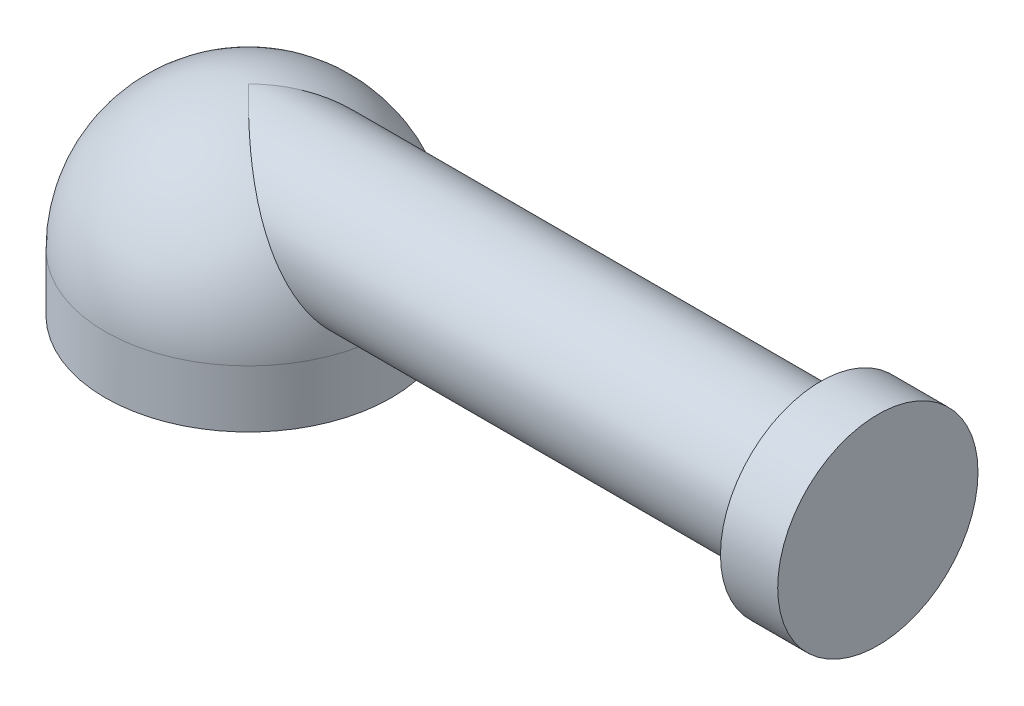
ISO-10303-21;
HEADER;
FILE_DESCRIPTION(('STEP AP214'),'2;1');
FILE_NAME('part.step','',(''),(''),'','','');
FILE_SCHEMA(('AUTOMOTIVE_DESIGN { 1 0 10303 214 1 1 1 1 }'));
ENDSEC;
DATA;
#1=APPLICATION_CONTEXT('core data for automotive mechanical design processes');
#2=APPLICATION_PROTOCOL_DEFINITION('international standard','automotive_design',2000,#1);
#3=PRODUCT_CONTEXT('',#1,'mechanical');
#4=PRODUCT('Part','Part','',(#3));
#5=PRODUCT_RELATED_PRODUCT_CATEGORY('part','',(#4));
#6=PRODUCT_DEFINITION_FORMATION('','',#4);
#7=PRODUCT_DEFINITION_CONTEXT('part definition',#1,'design');
#8=PRODUCT_DEFINITION('design','',#6,#7);
#9=PRODUCT_DEFINITION_SHAPE('','',#8);
#10=(LENGTH_UNIT() NAMED_UNIT(*) SI_UNIT(.MILLI.,.METRE.));
#11=(NAMED_UNIT(*) PLANE_ANGLE_UNIT() SI_UNIT($,.RADIAN.));
#12=(NAMED_UNIT(*) SI_UNIT($,.STERADIAN.) SOLID_ANGLE_UNIT());
#13=UNCERTAINTY_MEASURE_WITH_UNIT(LENGTH_MEASURE(1.E-05),#10,'distance_accuracy_value','');
#14=(GEOMETRIC_REPRESENTATION_CONTEXT(3) GLOBAL_UNCERTAINTY_ASSIGNED_CONTEXT((#13)) GLOBAL_UNIT_ASSIGNED_CONTEXT((#10,
#11,#12)) REPRESENTATION_CONTEXT('',''));
#15=CARTESIAN_POINT('',(0.,0.,0.));
#16=DIRECTION('',(0.,0.,1.));
#17=DIRECTION('',(1.,0.,0.));
#18=AXIS2_PLACEMENT_3D('',#15,#16,#17);
#19=CARTESIAN_POINT('',(0.,1.,0.));
#20=DIRECTION('',(0.,-1.,0.));
#21=DIRECTION('',(1.,0.,0.));
#22=AXIS2_PLACEMENT_3D('',#19,#20,#21);
#23=SPHERICAL_SURFACE('',#22,2.5);
#24=CARTESIAN_POINT('',(0.,3.5,0.));
#25=CARTESIAN_POINT('',(9.03465725767507E-10,3.5,-2.06603010067391E-06));
#26=CARTESIAN_POINT('',(1.40532408758934E-07,3.4999999999936,-4.13199815144162E-06));
#27=CARTESIAN_POINT('',(6.53975665339281E-07,3.49999999996992,-8.23515255964748E-06));
#28=CARTESIAN_POINT('',(1.02809638732858E-06,3.49999999995262,-1.0272297687369E-05));
#29=CARTESIAN_POINT('',(2.45048543547456E-06,3.49999999988667,-1.63415594684955E-05));
#30=CARTESIAN_POINT('',(3.79772910128829E-06,3.49999999982401,-2.03034893564983E-05));
#31=CARTESIAN_POINT('',(7.09223863791532E-06,3.49999999966981,-2.81414471541881E-05));
#32=CARTESIAN_POINT('',(9.06116815940649E-06,3.49999999957722,-3.20078478709065E-05));
#33=CARTESIAN_POINT('',(1.34137976448234E-05,3.49999999937095,-3.94803831920875E-05));
#34=CARTESIAN_POINT('',(1.57964479161004E-05,3.49999999925732,-4.30871445582485E-05));
#35=CARTESIAN_POINT('',(2.402061913195E-05,3.49999999886142,-5.45708131942331E-05));
#36=CARTESIAN_POINT('',(3.04121233245785E-05,3.49999999854823,-6.20538264996035E-05));
#37=CARTESIAN_POINT('',(4.39475112599543E-05,3.49999999786564,-7.60331718458684E-05));
#38=CARTESIAN_POINT('',(5.1078091916073E-05,3.49999999749719,-8.25430833792041E-05));
#39=CARTESIAN_POINT('',(7.72820483308929E-05,3.49999999609731,-0.000105448619225508));
#40=CARTESIAN_POINT('',(9.71341531021282E-05,3.49999999495188,-0.000120920093394432));
#41=CARTESIAN_POINT('',(0.000136456025350613,3.49999999201278,-0.000149768469616472));
#42=CARTESIAN_POINT('',(0.00015587304837256,3.49999999026375,-0.00016321577439628));
#43=CARTESIAN_POINT('',(0.000273199839284667,3.49999997681437,-0.000251786756117935));
#44=CARTESIAN_POINT('',(0.000354587015909807,3.49999995437845,-0.000346509765650201));
#45=CARTESIAN_POINT('',(0.000647071752567475,3.49999984531558,-0.000667196066757779));
#46=CARTESIAN_POINT('',(0.000870602926133935,3.4999997128575,-0.000878215813293108));
#47=CARTESIAN_POINT('',(0.00164605207464173,3.49999904804002,-0.0016269933482604));
#48=CARTESIAN_POINT('',(0.00218624347485647,3.49999821385135,-0.00217884474947019));
#49=CARTESIAN_POINT('',(0.00416700741413352,3.49999386223503,-0.00418667202475138));
#50=CARTESIAN_POINT('',(0.00561924575884219,3.49998818881235,-0.00562861637879351));
#51=CARTESIAN_POINT('',(0.0331442559621647,3.49983293758892,-0.0329754350340232));
#52=CARTESIAN_POINT('',(0.0590877299439648,3.49887459360956,-0.0590387968837171));
#53=CARTESIAN_POINT('',(0.110535267323236,3.49537108859278,-0.110485713211164));
#54=CARTESIAN_POINT('',(0.136038282692941,3.49285651557886,-0.135872757364566));
#55=CARTESIAN_POINT('',(0.188616591575509,3.48606388942968,-0.188096300229957));
#56=CARTESIAN_POINT('',(0.215689149061992,3.48168421958225,-0.214922748074373));
#57=CARTESIAN_POINT('',(0.269934882921645,3.471149643211,-0.268405374290015));
#58=CARTESIAN_POINT('',(0.297107852333861,3.4649856417184,-0.295059946502446));
#59=CARTESIAN_POINT('',(0.370300131728103,3.44599904239884,-0.366389010970893));
#60=CARTESIAN_POINT('',(0.416269102171267,3.43152844528726,-0.41068907079323));
#61=CARTESIAN_POINT('',(0.507341966063268,3.39786014613217,-0.497027378785424));
#62=CARTESIAN_POINT('',(0.552449191483231,3.37872846734192,-0.539087997866009));
#63=CARTESIAN_POINT('',(0.644971045216207,3.33450984476646,-0.623488172433074));
#64=CARTESIAN_POINT('',(0.692366992983383,3.30914087737651,-0.665701206585452));
#65=CARTESIAN_POINT('',(0.786882683990471,3.25322320857843,-0.747329018659638));
#66=CARTESIAN_POINT('',(0.834000717017869,3.22265537726524,-0.786732670376879));
#67=CARTESIAN_POINT('',(0.929511709296675,3.15535005188873,-0.863448924018073));
#68=CARTESIAN_POINT('',(0.977882473104846,3.11841803989198,-0.900619502578629));
#69=CARTESIAN_POINT('',(1.07381628667211,3.03968839877754,-0.970391730009778));
#70=CARTESIAN_POINT('',(1.12138012221424,2.99789585641763,-1.00299807815832));
#71=CARTESIAN_POINT('',(1.25579439994875,2.87223086377854,-1.0886035769605));
#72=CARTESIAN_POINT('',(1.3416306742188,2.78281551428343,-1.13534236337376));
#73=CARTESIAN_POINT('',(1.50818748792059,2.59289194148153,-1.20626772898903));
#74=CARTESIAN_POINT('',(1.5889534079097,2.49251452072161,-1.23069336301905));
#75=CARTESIAN_POINT('',(1.72456071902696,2.31169090061718,-1.25087680992923));
#76=CARTESIAN_POINT('',(1.78068684928329,2.23283978735695,-1.25243296629026));
#77=CARTESIAN_POINT('',(1.88922459270154,2.0735102126581,-1.24005568300901));
#78=CARTESIAN_POINT('',(1.94162998098111,1.99302930072666,-1.2260969073211));
#79=CARTESIAN_POINT('',(2.04198794922623,1.83312836123046,-1.18137828279186));
#80=CARTESIAN_POINT('',(2.08990995067002,1.75371839290745,-1.15051169290967));
#81=CARTESIAN_POINT('',(2.1797274648577,1.60032087582888,-1.07137355358718));
#82=CARTESIAN_POINT('',(2.22162992932475,1.52632712135793,-1.02312231071733));
#83=CARTESIAN_POINT('',(2.29293841499825,1.39741249348999,-0.917379141443187));
#84=CARTESIAN_POINT('',(2.32326748530558,1.34126509558173,-0.862008521899327));
#85=CARTESIAN_POINT('',(2.37749962257881,1.23929262339528,-0.73978465277191));
#86=CARTESIAN_POINT('',(2.40140980855601,1.1934561228035,-0.672944260051717));
#87=CARTESIAN_POINT('',(2.43905167475718,1.12053199775932,-0.540102487743382));
#88=CARTESIAN_POINT('',(2.45374534153547,1.09170837213939,-0.475323143235738));
#89=CARTESIAN_POINT('',(2.47728537948203,1.0452788331134,-0.340869572025986));
#90=CARTESIAN_POINT('',(2.48613600569621,1.02766475697512,-0.271198948270326));
#91=CARTESIAN_POINT('',(2.49713660428599,1.00573415198686,-0.136139178631497));
#92=CARTESIAN_POINT('',(2.49984341317038,1.00031302321876,-0.0709723397788174));
#93=CARTESIAN_POINT('',(2.50014322597658,0.99971370215609,0.0594125695685415));
#94=CARTESIAN_POINT('',(2.49773762970932,1.00453270604425,0.124630621153153));
#95=CARTESIAN_POINT('',(2.4880557093132,1.02384026623718,0.250954897882133));
#96=CARTESIAN_POINT('',(2.48094714651761,1.03799572670674,0.312125572111205));
#97=CARTESIAN_POINT('',(2.46222410986327,1.07501586130327,0.431034115370739));
#98=CARTESIAN_POINT('',(2.45060944665666,1.09788090140901,0.488771840029899));
#99=CARTESIAN_POINT('',(2.42282726836015,1.1520420322834,0.600794827144735));
#100=CARTESIAN_POINT('',(2.40655442748591,1.18353234014262,0.654959657755461));
#101=CARTESIAN_POINT('',(2.36996945345925,1.25343158378961,0.757089261533636));
#102=CARTESIAN_POINT('',(2.34965634277869,1.29184219370632,0.805052529613221));
#103=CARTESIAN_POINT('',(2.30377526315463,1.37727316973116,0.897263891747237));
#104=CARTESIAN_POINT('',(2.27793061123442,1.42471909388575,0.940978920748687));
#105=CARTESIAN_POINT('',(2.2225780288831,1.52436530277729,1.01980173891458));
#106=CARTESIAN_POINT('',(2.19306861090012,1.57656751581724,1.05490601560607));
#107=CARTESIAN_POINT('',(2.12743313033222,1.69008771872769,1.11969900859921));
#108=CARTESIAN_POINT('',(2.09093625457772,1.75177581476096,1.14836184482114));
#109=CARTESIAN_POINT('',(2.0146297359849,1.87708976451523,1.19495307774847));
#110=CARTESIAN_POINT('',(1.97481909173974,1.94071620028453,1.21287821605524));
#111=CARTESIAN_POINT('',(1.88689595545522,2.07672109237309,1.24012151776484));
#112=CARTESIAN_POINT('',(1.83838443906477,2.14913483763001,1.24797258382119));
#113=CARTESIAN_POINT('',(1.73837828530625,2.29221884715857,1.2513394475872));
#114=CARTESIAN_POINT('',(1.68688018350903,2.36288694535463,1.24684062752375));
#115=CARTESIAN_POINT('',(1.57385969227664,2.51063948316308,1.22511764586615));
#116=CARTESIAN_POINT('',(1.511962147834,2.58718111795508,1.206153187905));
#117=CARTESIAN_POINT('',(1.38585122495946,2.73335441459941,1.15535511207576));
#118=CARTESIAN_POINT('',(1.32164420044247,2.80300331318867,1.12355466068738));
#119=CARTESIAN_POINT('',(1.18272204870167,2.9426411168766,1.04404011003238));
#120=CARTESIAN_POINT('',(1.10773228781075,3.01147911661234,0.99478696515024));
#121=CARTESIAN_POINT('',(0.954831815841421,3.13768694585008,0.884109660943233));
#122=CARTESIAN_POINT('',(0.876895219926014,3.19488762008492,0.822528715676729));
#123=CARTESIAN_POINT('',(0.753596347509903,3.27363932855364,0.718954255122888));
#124=CARTESIAN_POINT('',(0.708665896023247,3.29993215829781,0.67995187163925));
#125=CARTESIAN_POINT('',(0.618370573068708,3.34786268314659,0.599492271973325));
#126=CARTESIAN_POINT('',(0.573005177247487,3.36949374459434,0.558031663270023));
#127=CARTESIAN_POINT('',(0.484328477909014,3.40691642380004,0.475390940990978));
#128=CARTESIAN_POINT('',(0.441030835230943,3.422950187342,0.434305011298923));
#129=CARTESIAN_POINT('',(0.354467035282944,3.45048645160054,0.351060243278618));
#130=CARTESIAN_POINT('',(0.311201859347762,3.46201181162419,0.308908002511101));
#131=CARTESIAN_POINT('',(0.247975026116913,3.47556195856667,0.246778073180658));
#132=CARTESIAN_POINT('',(0.228055390357256,3.47935502645118,0.22712748543014));
#133=CARTESIAN_POINT('',(0.18791401184717,3.48603888282501,0.18739987743631));
#134=CARTESIAN_POINT('',(0.167692017219012,3.48891601241765,0.167320774969541));
#135=CARTESIAN_POINT('',(0.123446073520968,3.49413447291043,0.123325238718038));
#136=CARTESIAN_POINT('',(0.0994163148333078,3.49627585231327,0.0993914300626676));
#137=CARTESIAN_POINT('',(0.0526543657297443,3.49909929863509,0.0526110976178393));
#138=CARTESIAN_POINT('',(0.0299193574538794,3.49985112743377,0.029772377484827));
#139=CARTESIAN_POINT('',(0.00562179062610069,3.49998817444402,0.00563108364963954));
#140=CARTESIAN_POINT('',(0.00417204356710078,3.49999384250027,0.00419166644416946));
#141=CARTESIAN_POINT('',(0.00219212115036177,3.49999820430814,0.00218470176068806));
#142=CARTESIAN_POINT('',(0.00165030200793372,3.49999904324291,0.00163116279548221));
#143=CARTESIAN_POINT('',(0.000872540967923787,3.49999971159545,0.000880184255871348));
#144=CARTESIAN_POINT('',(0.000648378010231976,3.49999984470849,0.000668583210112855));
#145=CARTESIAN_POINT('',(0.00035515235772886,3.49999995423835,0.00034704891769572));
#146=CARTESIAN_POINT('',(0.000273604694731109,3.49999997675535,0.000252126204341068));
#147=CARTESIAN_POINT('',(0.000156034802061506,3.49999999024403,0.000163412015324212));
#148=CARTESIAN_POINT('',(0.000136589137997332,3.49999999199693,0.0001499518810882));
#149=CARTESIAN_POINT('',(9.72104733275933E-05,3.49999999494237,0.00012107013148015));
#150=CARTESIAN_POINT('',(7.73305424400523E-05,3.49999999609008,0.000105577644711955));
#151=CARTESIAN_POINT('',(5.10947153982158E-05,3.49999999749268,8.26404539068264E-05));
#152=CARTESIAN_POINT('',(4.39574037859507E-05,3.49999999786176,7.61229000788026E-05));
#153=CARTESIAN_POINT('',(3.04104272953063E-05,3.49999999854555,6.21261822441603E-05));
#154=CARTESIAN_POINT('',(2.40141132008445E-05,3.49999999885931,5.46333946651884E-05));
#155=CARTESIAN_POINT('',(1.5785605255543E-05,3.49999999925594,4.31349866155268E-05));
#156=CARTESIAN_POINT('',(1.34021164293603E-05,3.49999999936977,3.9523890357782E-05));
#157=CARTESIAN_POINT('',(9.04866691395487E-06,3.4999999995764,3.2042386973218E-05));
#158=CARTESIAN_POINT('',(7.07975962930498E-06,3.49999999966916,2.81713514811042E-05));
#159=CARTESIAN_POINT('',(3.78650351581824E-06,3.49999999982364,2.03243162415033E-05));
#160=CARTESIAN_POINT('',(2.44042525496108E-06,3.49999999988643,1.63579590185354E-05));
#161=CARTESIAN_POINT('',(1.02089773831582E-06,3.49999999995251,1.02822573499865E-05));
#162=CARTESIAN_POINT('',(6.47911218902655E-07,3.49999999996984,8.24301625174064E-06));
#163=CARTESIAN_POINT('',(1.3716411466838E-07,3.49999999999358,4.13580192788885E-06));
#164=CARTESIAN_POINT('',(-9.04270254798268E-10,3.5,2.06786988371191E-06));
#165=CARTESIAN_POINT('',(0.,3.5,0.));
#166=B_SPLINE_CURVE_WITH_KNOTS('',3,(#24,#25,#26,#27,#28,#29,#30,#31,#32,#33,#34,#35,#36,#37,
#38,#39,#40,#41,#42,#43,#44,#45,#46,#47,#48,#49,#50,#51,#52,#53,#54,#55,#56,#57,#58,#59,#60,#61,
#62,#63,#64,#65,#66,#67,#68,#69,#70,#71,#72,#73,#74,#75,#76,#77,#78,#79,#80,#81,#82,#83,#84,#85,
#86,#87,#88,#89,#90,#91,#92,#93,#94,#95,#96,#97,#98,#99,#100,#101,#102,#103,#104,#105,#106,#107,
#108,#109,#110,#111,#112,#113,#114,#115,#116,#117,#118,#119,#120,#121,#122,#123,#124,#125,#126,
#127,#128,#129,#130,#131,#132,#133,#134,#135,#136,#137,#138,#139,#140,#141,#142,#143,#144,#145,
#146,#147,#148,#149,#150,#151,#152,#153,#154,#155,#156,#157,#158,#159,#160,#161,#162,#163,#164,
#165),.UNSPECIFIED.,.T.,.F.,(4,2,2,2,2,2,2,2,2,2,2,2,2,2,2,2,2,2,2,2,2,2,2,2,2,2,2,2,2,2,2,2,2,
2,2,2,2,2,2,2,2,2,2,2,2,2,2,2,2,2,2,2,2,2,2,2,2,2,2,2,2,2,2,2,2,2,2,2,2,2,4),(0.,
6.19497237579534E-06,1.23980565945574E-05,2.48867198699285E-05,3.78703257486531E-05,
5.08214585247521E-05,8.02195603431655E-05,0.0001091587265821,0.000184600448047914,
0.000255359783520054,0.00062635236607428,0.00155060743073989,0.00386491318270473,
0.0100064392733568,0.120300616372325,0.228492916674136,0.343538584255776,0.459181303047181,
0.655337982070794,0.848863028289331,1.05366321445726,1.25923397319844,1.47284344756615,
1.68623134851631,2.08121897431549,2.47192344936617,2.76114546918208,3.05084048639125,
3.34238582083919,3.63359170682821,3.88555760235025,4.13724288387613,4.35328045910345,
4.56916053640325,4.76452549844168,4.95983697513106,5.14853208279965,5.33723512035975,
5.53059705214964,5.72400582416823,5.93164612757001,6.1393709906664,6.37003097679507,
6.60076092223511,6.86226919156692,7.12408712498983,7.42363283468237,7.72240946314785,
8.06032919106421,8.40285617268335,8.59781564612948,8.79305073978299,8.97829675488851,
9.16259093546582,9.24728923944126,9.33319710816037,9.43512423140785,9.531778503085,
9.53790939019433,9.54023071295022,9.5411575558037,9.54152929989953,9.5416001514674,
9.54167569720697,9.54170466664759,9.54173409599867,9.54174705932668,9.54176005520582,
9.54177255515759,9.54177876378765,9.54178496427659),.UNSPECIFIED.);
#167=CARTESIAN_POINT('',(2.5,1.,0.));
#168=VERTEX_POINT('',#167);
#169=CARTESIAN_POINT('',(0.,3.5,0.));
#170=VERTEX_POINT('',#169);
#171=EDGE_CURVE('E48',#168,#170,#166,.T.);
#172=ORIENTED_EDGE('',*,*,#171,.T.);
#173=EDGE_CURVE('E12',#170,#168,#166,.T.);
#174=ORIENTED_EDGE('',*,*,#173,.T.);
#175=CARTESIAN_POINT('',(0.,1.,0.));
#176=DIRECTION('',(0.,1.,0.));
#177=DIRECTION('',(0.,0.,1.));
#178=AXIS2_PLACEMENT_3D('',#175,#176,#177);
#179=CIRCLE('',#178,2.5);
#180=EDGE_CURVE('E68',#168,#168,#179,.T.);
#181=ORIENTED_EDGE('',*,*,#180,.T.);
#182=EDGE_LOOP('',(#172,#174,#181));
#183=FACE_BOUND('',#182,.T.);
#184=ADVANCED_FACE('F44',(#183),#23,.T.);
#185=CARTESIAN_POINT('',(0.,0.,0.));
#186=DIRECTION('',(0.,1.,0.));
#187=DIRECTION('',(0.,0.,1.));
#188=AXIS2_PLACEMENT_3D('',#185,#186,#187);
#189=PLANE('',#188);
#190=CARTESIAN_POINT('',(0.,0.,0.));
#191=DIRECTION('',(0.,1.,0.));
#192=DIRECTION('',(0.,0.,1.));
#193=AXIS2_PLACEMENT_3D('',#190,#191,#192);
#194=CIRCLE('',#193,2.5);
#195=CARTESIAN_POINT('',(0.,0.,2.5));
#196=VERTEX_POINT('',#195);
#197=EDGE_CURVE('E71',#196,#196,#194,.T.);
#198=ORIENTED_EDGE('',*,*,#197,.F.);
#199=EDGE_LOOP('',(#198));
#200=FACE_BOUND('',#199,.T.);
#201=CARTESIAN_POINT('',(0.,0.,0.));
#202=DIRECTION('',(0.,1.,0.));
#203=DIRECTION('',(0.,0.,1.));
#204=AXIS2_PLACEMENT_3D('',#201,#202,#203);
#205=CIRCLE('',#204,2.);
#206=CARTESIAN_POINT('',(0.,0.,2.));
#207=VERTEX_POINT('',#206);
#208=EDGE_CURVE('E74',#207,#207,#205,.T.);
#209=ORIENTED_EDGE('',*,*,#208,.T.);
#210=EDGE_LOOP('',(#209));
#211=FACE_BOUND('',#210,.T.);
#212=ADVANCED_FACE('F108',(#200,#211),#189,.F.);
#213=CARTESIAN_POINT('',(0.,1.,0.));
#214=DIRECTION('',(0.,-1.,0.));
#215=DIRECTION('',(0.,0.,-1.));
#216=AXIS2_PLACEMENT_3D('',#213,#214,#215);
#217=CYLINDRICAL_SURFACE('',#216,2.5);
#218=ORIENTED_EDGE('',*,*,#180,.F.);
#219=EDGE_LOOP('',(#218));
#220=FACE_BOUND('',#219,.T.);
#221=ORIENTED_EDGE('',*,*,#197,.T.);
#222=EDGE_LOOP('',(#221));
#223=FACE_BOUND('',#222,.T.);
#224=ADVANCED_FACE('F46',(#220,#223),#217,.T.);
#225=CARTESIAN_POINT('',(0.,1.,0.));
#226=DIRECTION('',(0.,-1.,0.));
#227=DIRECTION('',(0.,0.,-1.));
#228=AXIS2_PLACEMENT_3D('',#225,#226,#227);
#229=CYLINDRICAL_SURFACE('',#228,2.);
#230=CARTESIAN_POINT('',(0.,1.,0.));
#231=DIRECTION('',(0.,-1.,0.));
#232=DIRECTION('',(0.,0.,-1.));
#233=AXIS2_PLACEMENT_3D('',#230,#231,#232);
#234=CIRCLE('',#233,2.);
#235=CARTESIAN_POINT('',(0.,1.,-2.));
#236=VERTEX_POINT('',#235);
#237=EDGE_CURVE('E78',#236,#236,#234,.T.);
#238=ORIENTED_EDGE('',*,*,#237,.F.);
#239=EDGE_LOOP('',(#238));
#240=FACE_BOUND('',#239,.T.);
#241=ORIENTED_EDGE('',*,*,#208,.F.);
#242=EDGE_LOOP('',(#241));
#243=FACE_BOUND('',#242,.T.);
#244=ADVANCED_FACE('F119',(#240,#243),#229,.F.);
#245=CARTESIAN_POINT('',(0.,1.,0.));
#246=DIRECTION('',(0.,-1.,0.));
#247=DIRECTION('',(0.,0.,-1.));
#248=AXIS2_PLACEMENT_3D('',#245,#246,#247);
#249=PLANE('',#248);
#250=ORIENTED_EDGE('',*,*,#237,.T.);
#251=EDGE_LOOP('',(#250));
#252=FACE_BOUND('',#251,.T.);
#253=ADVANCED_FACE('F116',(#252),#249,.T.);
#254=CARTESIAN_POINT('',(10.,2.25,0.));
#255=DIRECTION('',(-1.,0.,0.));
#256=DIRECTION('',(0.,0.,1.));
#257=AXIS2_PLACEMENT_3D('',#254,#255,#256);
#258=CYLINDRICAL_SURFACE('',#257,1.25);
#259=ORIENTED_EDGE('',*,*,#173,.F.);
#260=ORIENTED_EDGE('',*,*,#171,.F.);
#261=EDGE_LOOP('',(#259,#260));
#262=FACE_BOUND('',#261,.T.);
#263=CARTESIAN_POINT('',(10.,2.25,0.));
#264=DIRECTION('',(1.,0.,0.));
#265=DIRECTION('',(0.,0.,-1.));
#266=AXIS2_PLACEMENT_3D('',#263,#264,#265);
#267=CIRCLE('',#266,1.25);
#268=CARTESIAN_POINT('',(10.,2.25,-1.25));
#269=VERTEX_POINT('',#268);
#270=EDGE_CURVE('E81',#269,#269,#267,.T.);
#271=ORIENTED_EDGE('',*,*,#270,.F.);
#272=EDGE_LOOP('',(#271));
#273=FACE_BOUND('',#272,.T.);
#274=ADVANCED_FACE('F64',(#262,#273),#258,.T.);
#275=CARTESIAN_POINT('',(11.,2.25,0.));
#276=DIRECTION('',(-1.,0.,0.));
#277=DIRECTION('',(0.,0.,1.));
#278=AXIS2_PLACEMENT_3D('',#275,#276,#277);
#279=CYLINDRICAL_SURFACE('',#278,1.75);
#280=CARTESIAN_POINT('',(11.,2.25,0.));
#281=DIRECTION('',(1.,0.,0.));
#282=DIRECTION('',(0.,0.,-1.));
#283=AXIS2_PLACEMENT_3D('',#280,#281,#282);
#284=CIRCLE('',#283,1.75);
#285=CARTESIAN_POINT('',(11.,2.25,-1.75));
#286=VERTEX_POINT('',#285);
#287=EDGE_CURVE('E84',#286,#286,#284,.T.);
#288=ORIENTED_EDGE('',*,*,#287,.F.);
#289=EDGE_LOOP('',(#288));
#290=FACE_BOUND('',#289,.T.);
#291=CARTESIAN_POINT('',(10.,2.25,0.));
#292=DIRECTION('',(1.,0.,0.));
#293=DIRECTION('',(0.,0.,-1.));
#294=AXIS2_PLACEMENT_3D('',#291,#292,#293);
#295=CIRCLE('',#294,1.75);
#296=CARTESIAN_POINT('',(10.,2.25,-1.75));
#297=VERTEX_POINT('',#296);
#298=EDGE_CURVE('E85',#297,#297,#295,.T.);
#299=ORIENTED_EDGE('',*,*,#298,.T.);
#300=EDGE_LOOP('',(#299));
#301=FACE_BOUND('',#300,.T.);
#302=ADVANCED_FACE('F93',(#290,#301),#279,.T.);
#303=CARTESIAN_POINT('',(11.,2.25,0.));
#304=DIRECTION('',(1.,0.,0.));
#305=DIRECTION('',(0.,0.,-1.));
#306=AXIS2_PLACEMENT_3D('',#303,#304,#305);
#307=PLANE('',#306);
#308=ORIENTED_EDGE('',*,*,#287,.T.);
#309=EDGE_LOOP('',(#308));
#310=FACE_BOUND('',#309,.T.);
#311=ADVANCED_FACE('F91',(#310),#307,.T.);
#312=CARTESIAN_POINT('',(10.,2.25,0.));
#313=DIRECTION('',(1.,0.,0.));
#314=DIRECTION('',(0.,0.,-1.));
#315=AXIS2_PLACEMENT_3D('',#312,#313,#314);
#316=PLANE('',#315);
#317=ORIENTED_EDGE('',*,*,#270,.T.);
#318=EDGE_LOOP('',(#317));
#319=FACE_BOUND('',#318,.T.);
#320=ORIENTED_EDGE('',*,*,#298,.F.);
#321=EDGE_LOOP('',(#320));
#322=FACE_BOUND('',#321,.T.);
#323=ADVANCED_FACE('F99',(#319,#322),#316,.F.);
#324=CLOSED_SHELL('',(#184,#212,#224,#244,#253,#274,#302,#311,#323));
#325=MANIFOLD_SOLID_BREP('B2',#324);
#326=ADVANCED_BREP_SHAPE_REPRESENTATION('',(#18,#325),#14);
#327=SHAPE_DEFINITION_REPRESENTATION(#9,#326);
ENDSEC;
END-ISO-10303-21;
